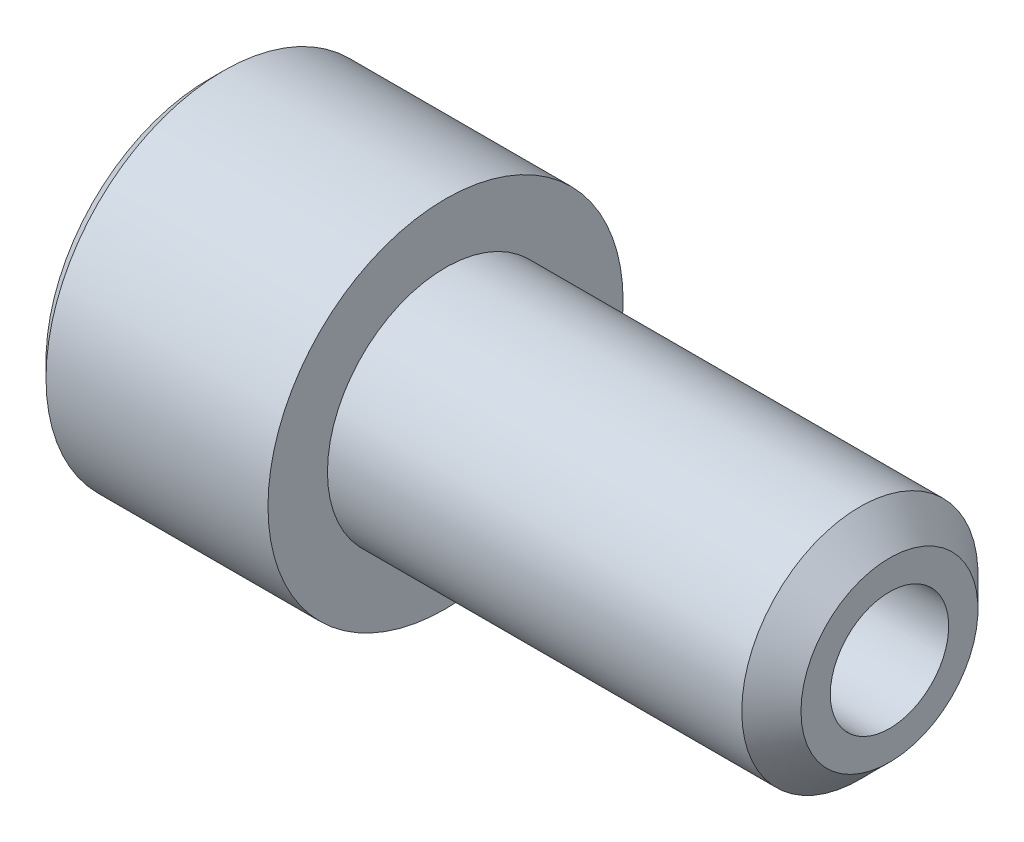
ISO-10303-21;
HEADER;
FILE_DESCRIPTION(('STEP AP214'),'2;1');
FILE_NAME('part.step','',(''),(''),'','','');
FILE_SCHEMA(('AUTOMOTIVE_DESIGN { 1 0 10303 214 1 1 1 1 }'));
ENDSEC;
DATA;
#1=APPLICATION_CONTEXT('core data for automotive mechanical design processes');
#2=APPLICATION_PROTOCOL_DEFINITION('international standard','automotive_design',2000,#1);
#3=PRODUCT_CONTEXT('',#1,'mechanical');
#4=PRODUCT('Part','Part','',(#3));
#5=PRODUCT_RELATED_PRODUCT_CATEGORY('part','',(#4));
#6=PRODUCT_DEFINITION_FORMATION('','',#4);
#7=PRODUCT_DEFINITION_CONTEXT('part definition',#1,'design');
#8=PRODUCT_DEFINITION('design','',#6,#7);
#9=PRODUCT_DEFINITION_SHAPE('','',#8);
#10=(LENGTH_UNIT() NAMED_UNIT(*) SI_UNIT(.MILLI.,.METRE.));
#11=(NAMED_UNIT(*) PLANE_ANGLE_UNIT() SI_UNIT($,.RADIAN.));
#12=(NAMED_UNIT(*) SI_UNIT($,.STERADIAN.) SOLID_ANGLE_UNIT());
#13=UNCERTAINTY_MEASURE_WITH_UNIT(LENGTH_MEASURE(1.E-05),#10,'distance_accuracy_value','');
#14=(GEOMETRIC_REPRESENTATION_CONTEXT(3) GLOBAL_UNCERTAINTY_ASSIGNED_CONTEXT((#13)) GLOBAL_UNIT_ASSIGNED_CONTEXT((#10,
#11,#12)) REPRESENTATION_CONTEXT('',''));
#15=CARTESIAN_POINT('',(0.,0.,0.));
#16=DIRECTION('',(0.,0.,1.));
#17=DIRECTION('',(1.,0.,0.));
#18=AXIS2_PLACEMENT_3D('',#15,#16,#17);
#19=CARTESIAN_POINT('',(0.,0.,0.));
#20=DIRECTION('',(1.,0.,0.));
#21=DIRECTION('',(0.,0.,-1.));
#22=AXIS2_PLACEMENT_3D('',#19,#20,#21);
#23=PLANE('',#22);
#24=DIRECTION('',(0.,0.866025403784439,0.5));
#25=VECTOR('',#24,1.);
#26=CARTESIAN_POINT('',(0.,7.5,-4.90747728811183));
#27=LINE('',#26,#25);
#28=CARTESIAN_POINT('',(0.,0.,-9.23760430703402));
#29=VERTEX_POINT('',#28);
#30=CARTESIAN_POINT('',(0.,8.,-4.61880215351701));
#31=VERTEX_POINT('',#30);
#32=EDGE_CURVE('E171',#29,#31,#27,.T.);
#33=ORIENTED_EDGE('',*,*,#32,.T.);
#34=DIRECTION('',(0.,0.,1.));
#35=VECTOR('',#34,1.);
#36=CARTESIAN_POINT('',(0.,8.,4.04145188432738));
#37=LINE('',#36,#35);
#38=CARTESIAN_POINT('',(0.,8.,4.61880215351701));
#39=VERTEX_POINT('',#38);
#40=EDGE_CURVE('E186',#31,#39,#37,.T.);
#41=ORIENTED_EDGE('',*,*,#40,.T.);
#42=DIRECTION('',(0.,-0.866025403784439,0.5));
#43=VECTOR('',#42,1.);
#44=CARTESIAN_POINT('',(0.,0.500000000000005,8.94892917243921));
#45=LINE('',#44,#43);
#46=CARTESIAN_POINT('',(0.,0.,9.23760430703402));
#47=VERTEX_POINT('',#46);
#48=EDGE_CURVE('E183',#39,#47,#45,.T.);
#49=ORIENTED_EDGE('',*,*,#48,.T.);
#50=DIRECTION('',(0.,-0.866025403784439,-0.5));
#51=VECTOR('',#50,1.);
#52=CARTESIAN_POINT('',(0.,-7.5,4.90747728811183));
#53=LINE('',#52,#51);
#54=CARTESIAN_POINT('',(0.,-8.,4.61880215351701));
#55=VERTEX_POINT('',#54);
#56=EDGE_CURVE('E180',#47,#55,#53,.T.);
#57=ORIENTED_EDGE('',*,*,#56,.T.);
#58=DIRECTION('',(0.,0.,-1.));
#59=VECTOR('',#58,1.);
#60=CARTESIAN_POINT('',(0.,-8.,-4.04145188432738));
#61=LINE('',#60,#59);
#62=CARTESIAN_POINT('',(0.,-8.,-4.61880215351701));
#63=VERTEX_POINT('',#62);
#64=EDGE_CURVE('E177',#55,#63,#61,.T.);
#65=ORIENTED_EDGE('',*,*,#64,.T.);
#66=DIRECTION('',(0.,0.866025403784439,-0.5));
#67=VECTOR('',#66,1.);
#68=CARTESIAN_POINT('',(0.,-0.500000000000001,-8.9489291724392));
#69=LINE('',#68,#67);
#70=EDGE_CURVE('E174',#63,#29,#69,.T.);
#71=ORIENTED_EDGE('',*,*,#70,.T.);
#72=EDGE_LOOP('',(#33,#41,#49,#57,#65,#71));
#73=FACE_BOUND('',#72,.T.);
#74=CARTESIAN_POINT('',(0.,0.,0.));
#75=DIRECTION('',(1.,0.,0.));
#76=DIRECTION('',(0.,0.,-1.));
#77=AXIS2_PLACEMENT_3D('',#74,#75,#76);
#78=CIRCLE('',#77,11.);
#79=CARTESIAN_POINT('',(0.,0.,-11.));
#80=VERTEX_POINT('',#79);
#81=EDGE_CURVE('E163',#80,#80,#78,.F.);
#82=ORIENTED_EDGE('',*,*,#81,.T.);
#83=EDGE_LOOP('',(#82));
#84=FACE_BOUND('',#83,.T.);
#85=ADVANCED_FACE('F39',(#73,#84),#23,.F.);
#86=CARTESIAN_POINT('',(46.,0.,0.));
#87=DIRECTION('',(-1.,0.,0.));
#88=DIRECTION('',(0.,0.,1.));
#89=AXIS2_PLACEMENT_3D('',#86,#87,#88);
#90=PLANE('',#89);
#91=CARTESIAN_POINT('',(46.,0.,0.));
#92=DIRECTION('',(-1.,0.,0.));
#93=DIRECTION('',(0.,0.,1.));
#94=AXIS2_PLACEMENT_3D('',#91,#92,#93);
#95=CIRCLE('',#94,4.);
#96=CARTESIAN_POINT('',(46.,0.,4.));
#97=VERTEX_POINT('',#96);
#98=EDGE_CURVE('E208',#97,#97,#95,.T.);
#99=ORIENTED_EDGE('',*,*,#98,.T.);
#100=EDGE_LOOP('',(#99));
#101=FACE_BOUND('',#100,.T.);
#102=CARTESIAN_POINT('',(46.,0.,0.));
#103=DIRECTION('',(-1.,0.,0.));
#104=DIRECTION('',(0.,0.,1.));
#105=AXIS2_PLACEMENT_3D('',#102,#103,#104);
#106=CIRCLE('',#105,5.98100000000001);
#107=CARTESIAN_POINT('',(46.,0.,5.98100000000001));
#108=VERTEX_POINT('',#107);
#109=EDGE_CURVE('E159',#108,#108,#106,.F.);
#110=ORIENTED_EDGE('',*,*,#109,.T.);
#111=EDGE_LOOP('',(#110));
#112=FACE_BOUND('',#111,.T.);
#113=ADVANCED_FACE('F265',(#101,#112),#90,.F.);
#114=CARTESIAN_POINT('',(-88.7054908485857,0.,0.));
#115=DIRECTION('',(-1.,0.,0.));
#116=DIRECTION('',(0.,0.,1.));
#117=AXIS2_PLACEMENT_3D('',#114,#115,#116);
#118=CYLINDRICAL_SURFACE('',#117,7.981);
#119=CARTESIAN_POINT('',(44.,0.,0.));
#120=DIRECTION('',(-1.,0.,0.));
#121=DIRECTION('',(0.,0.,1.));
#122=AXIS2_PLACEMENT_3D('',#119,#120,#121);
#123=CIRCLE('',#122,7.981);
#124=CARTESIAN_POINT('',(44.,0.,7.981));
#125=VERTEX_POINT('',#124);
#126=EDGE_CURVE('E155',#125,#125,#123,.T.);
#127=ORIENTED_EDGE('',*,*,#126,.T.);
#128=EDGE_LOOP('',(#127));
#129=FACE_BOUND('',#128,.T.);
#130=CARTESIAN_POINT('',(16.,0.,0.));
#131=DIRECTION('',(-1.,0.,0.));
#132=DIRECTION('',(0.,0.,1.));
#133=AXIS2_PLACEMENT_3D('',#130,#131,#132);
#134=CIRCLE('',#133,7.981);
#135=CARTESIAN_POINT('',(16.,0.,7.981));
#136=VERTEX_POINT('',#135);
#137=EDGE_CURVE('E146',#136,#136,#134,.T.);
#138=ORIENTED_EDGE('',*,*,#137,.F.);
#139=EDGE_LOOP('',(#138));
#140=FACE_BOUND('',#139,.T.);
#141=ADVANCED_FACE('F291',(#129,#140),#118,.T.);
#142=CARTESIAN_POINT('',(16.,7.981,0.));
#143=DIRECTION('',(-1.,0.,0.));
#144=DIRECTION('',(0.,0.,1.));
#145=AXIS2_PLACEMENT_3D('',#142,#143,#144);
#146=PLANE('',#145);
#147=CARTESIAN_POINT('',(16.,0.,0.));
#148=DIRECTION('',(-1.,0.,0.));
#149=DIRECTION('',(0.,0.,1.));
#150=AXIS2_PLACEMENT_3D('',#147,#148,#149);
#151=CIRCLE('',#150,12.);
#152=CARTESIAN_POINT('',(16.,0.,12.));
#153=VERTEX_POINT('',#152);
#154=EDGE_CURVE('E140',#153,#153,#151,.T.);
#155=ORIENTED_EDGE('',*,*,#154,.F.);
#156=EDGE_LOOP('',(#155));
#157=FACE_BOUND('',#156,.T.);
#158=ORIENTED_EDGE('',*,*,#137,.T.);
#159=EDGE_LOOP('',(#158));
#160=FACE_BOUND('',#159,.T.);
#161=ADVANCED_FACE('F301',(#157,#160),#146,.F.);
#162=CARTESIAN_POINT('',(-88.7054908485857,0.,0.));
#163=DIRECTION('',(-1.,0.,0.));
#164=DIRECTION('',(0.,0.,1.));
#165=AXIS2_PLACEMENT_3D('',#162,#163,#164);
#166=CYLINDRICAL_SURFACE('',#165,12.);
#167=CARTESIAN_POINT('',(0.999999999999987,0.,0.));
#168=DIRECTION('',(1.,0.,0.));
#169=DIRECTION('',(0.,0.,-1.));
#170=AXIS2_PLACEMENT_3D('',#167,#168,#169);
#171=CIRCLE('',#170,12.);
#172=CARTESIAN_POINT('',(0.999999999999987,0.,-12.));
#173=VERTEX_POINT('',#172);
#174=EDGE_CURVE('E167',#173,#173,#171,.T.);
#175=ORIENTED_EDGE('',*,*,#174,.T.);
#176=EDGE_LOOP('',(#175));
#177=FACE_BOUND('',#176,.T.);
#178=ORIENTED_EDGE('',*,*,#154,.T.);
#179=EDGE_LOOP('',(#178));
#180=FACE_BOUND('',#179,.T.);
#181=ADVANCED_FACE('F297',(#177,#180),#166,.T.);
#182=CARTESIAN_POINT('',(44.,0.,0.));
#183=DIRECTION('',(-1.,0.,0.));
#184=DIRECTION('',(0.,0.,1.));
#185=AXIS2_PLACEMENT_3D('',#182,#183,#184);
#186=CONICAL_SURFACE('',#185,7.981,0.785398163397449);
#187=ORIENTED_EDGE('',*,*,#109,.F.);
#188=EDGE_LOOP('',(#187));
#189=FACE_BOUND('',#188,.T.);
#190=ORIENTED_EDGE('',*,*,#126,.F.);
#191=EDGE_LOOP('',(#190));
#192=FACE_BOUND('',#191,.T.);
#193=ADVANCED_FACE('F300',(#189,#192),#186,.T.);
#194=CARTESIAN_POINT('',(0.,0.,0.));
#195=DIRECTION('',(1.,0.,0.));
#196=DIRECTION('',(0.,0.,-1.));
#197=AXIS2_PLACEMENT_3D('',#194,#195,#196);
#198=CONICAL_SURFACE('',#197,11.,0.785398163397444);
#199=ORIENTED_EDGE('',*,*,#174,.F.);
#200=EDGE_LOOP('',(#199));
#201=FACE_BOUND('',#200,.T.);
#202=ORIENTED_EDGE('',*,*,#81,.F.);
#203=EDGE_LOOP('',(#202));
#204=FACE_BOUND('',#203,.T.);
#205=ADVANCED_FACE('F311',(#201,#204),#198,.T.);
#206=CARTESIAN_POINT('',(8.,7.,4.04145188432738));
#207=DIRECTION('',(0.,-0.5,-0.866025403784439));
#208=DIRECTION('',(0.,0.866025403784438,-0.5));
#209=AXIS2_PLACEMENT_3D('',#206,#207,#208);
#210=PLANE('',#209);
#211=DIRECTION('',(-1.,0.,0.));
#212=VECTOR('',#211,1.);
#213=CARTESIAN_POINT('',(8.,0.,8.08290376865476));
#214=LINE('',#213,#212);
#215=CARTESIAN_POINT('',(8.,0.,8.08290376865476));
#216=VERTEX_POINT('',#215);
#217=CARTESIAN_POINT('',(1.00000000000001,0.,8.08290376865476));
#218=VERTEX_POINT('',#217);
#219=EDGE_CURVE('E130',#216,#218,#214,.T.);
#220=ORIENTED_EDGE('',*,*,#219,.T.);
#221=DIRECTION('',(0.,0.866025403784438,-0.5));
#222=VECTOR('',#221,1.);
#223=CARTESIAN_POINT('',(1.00000000000001,7.,4.04145188432738));
#224=LINE('',#223,#222);
#225=CARTESIAN_POINT('',(1.00000000000001,7.,4.04145188432738));
#226=VERTEX_POINT('',#225);
#227=EDGE_CURVE('E194',#218,#226,#224,.T.);
#228=ORIENTED_EDGE('',*,*,#227,.T.);
#229=DIRECTION('',(-1.,0.,0.));
#230=VECTOR('',#229,1.);
#231=CARTESIAN_POINT('',(8.,7.,4.04145188432738));
#232=LINE('',#231,#230);
#233=CARTESIAN_POINT('',(8.,7.,4.04145188432738));
#234=VERTEX_POINT('',#233);
#235=EDGE_CURVE('E133',#234,#226,#232,.T.);
#236=ORIENTED_EDGE('',*,*,#235,.F.);
#237=DIRECTION('',(0.,-0.866025403784438,0.5));
#238=VECTOR('',#237,1.);
#239=CARTESIAN_POINT('',(8.,7.,4.04145188432738));
#240=LINE('',#239,#238);
#241=EDGE_CURVE('E117',#234,#216,#240,.T.);
#242=ORIENTED_EDGE('',*,*,#241,.T.);
#243=EDGE_LOOP('',(#220,#228,#236,#242));
#244=FACE_BOUND('',#243,.T.);
#245=ADVANCED_FACE('F129',(#244),#210,.T.);
#246=CARTESIAN_POINT('',(8.,0.,8.08290376865476));
#247=DIRECTION('',(0.,0.5,-0.866025403784439));
#248=DIRECTION('',(0.,0.866025403784439,0.5));
#249=AXIS2_PLACEMENT_3D('',#246,#247,#248);
#250=PLANE('',#249);
#251=DIRECTION('',(-1.,0.,0.));
#252=VECTOR('',#251,1.);
#253=CARTESIAN_POINT('',(8.,-7.,4.04145188432738));
#254=LINE('',#253,#252);
#255=CARTESIAN_POINT('',(8.,-7.,4.04145188432738));
#256=VERTEX_POINT('',#255);
#257=CARTESIAN_POINT('',(1.00000000000001,-7.,4.04145188432738));
#258=VERTEX_POINT('',#257);
#259=EDGE_CURVE('E141',#256,#258,#254,.T.);
#260=ORIENTED_EDGE('',*,*,#259,.T.);
#261=DIRECTION('',(0.,0.866025403784439,0.5));
#262=VECTOR('',#261,1.);
#263=CARTESIAN_POINT('',(1.00000000000001,0.,8.08290376865476));
#264=LINE('',#263,#262);
#265=EDGE_CURVE('E138',#258,#218,#264,.T.);
#266=ORIENTED_EDGE('',*,*,#265,.T.);
#267=ORIENTED_EDGE('',*,*,#219,.F.);
#268=DIRECTION('',(0.,-0.866025403784439,-0.5));
#269=VECTOR('',#268,1.);
#270=CARTESIAN_POINT('',(8.,0.,8.08290376865476));
#271=LINE('',#270,#269);
#272=EDGE_CURVE('E113',#216,#256,#271,.T.);
#273=ORIENTED_EDGE('',*,*,#272,.T.);
#274=EDGE_LOOP('',(#260,#266,#267,#273));
#275=FACE_BOUND('',#274,.T.);
#276=ADVANCED_FACE('F136',(#275),#250,.T.);
#277=CARTESIAN_POINT('',(8.,-7.,4.04145188432738));
#278=DIRECTION('',(0.,1.,0.));
#279=DIRECTION('',(0.,0.,1.));
#280=AXIS2_PLACEMENT_3D('',#277,#278,#279);
#281=PLANE('',#280);
#282=DIRECTION('',(-1.,0.,0.));
#283=VECTOR('',#282,1.);
#284=CARTESIAN_POINT('',(8.,-7.,-4.04145188432738));
#285=LINE('',#284,#283);
#286=CARTESIAN_POINT('',(8.,-7.,-4.04145188432738));
#287=VERTEX_POINT('',#286);
#288=CARTESIAN_POINT('',(1.00000000000001,-7.,-4.04145188432738));
#289=VERTEX_POINT('',#288);
#290=EDGE_CURVE('E148',#287,#289,#285,.T.);
#291=ORIENTED_EDGE('',*,*,#290,.T.);
#292=DIRECTION('',(0.,0.,1.));
#293=VECTOR('',#292,1.);
#294=CARTESIAN_POINT('',(1.00000000000001,-7.,4.04145188432738));
#295=LINE('',#294,#293);
#296=EDGE_CURVE('E199',#289,#258,#295,.T.);
#297=ORIENTED_EDGE('',*,*,#296,.T.);
#298=ORIENTED_EDGE('',*,*,#259,.F.);
#299=DIRECTION('',(0.,0.,-1.));
#300=VECTOR('',#299,1.);
#301=CARTESIAN_POINT('',(8.,-7.,4.04145188432738));
#302=LINE('',#301,#300);
#303=EDGE_CURVE('E119',#256,#287,#302,.T.);
#304=ORIENTED_EDGE('',*,*,#303,.T.);
#305=EDGE_LOOP('',(#291,#297,#298,#304));
#306=FACE_BOUND('',#305,.T.);
#307=ADVANCED_FACE('F235',(#306),#281,.T.);
#308=CARTESIAN_POINT('',(8.,-7.,-4.04145188432738));
#309=DIRECTION('',(0.,0.5,0.866025403784439));
#310=DIRECTION('',(0.,-0.866025403784439,0.5));
#311=AXIS2_PLACEMENT_3D('',#308,#309,#310);
#312=PLANE('',#311);
#313=DIRECTION('',(-1.,0.,0.));
#314=VECTOR('',#313,1.);
#315=CARTESIAN_POINT('',(8.,0.,-8.08290376865476));
#316=LINE('',#315,#314);
#317=CARTESIAN_POINT('',(8.,0.,-8.08290376865476));
#318=VERTEX_POINT('',#317);
#319=CARTESIAN_POINT('',(1.00000000000001,0.,-8.08290376865476));
#320=VERTEX_POINT('',#319);
#321=EDGE_CURVE('E237',#318,#320,#316,.T.);
#322=ORIENTED_EDGE('',*,*,#321,.T.);
#323=DIRECTION('',(0.,-0.866025403784439,0.5));
#324=VECTOR('',#323,1.);
#325=CARTESIAN_POINT('',(1.00000000000001,-7.,-4.04145188432738));
#326=LINE('',#325,#324);
#327=EDGE_CURVE('E49',#320,#289,#326,.T.);
#328=ORIENTED_EDGE('',*,*,#327,.T.);
#329=ORIENTED_EDGE('',*,*,#290,.F.);
#330=DIRECTION('',(0.,0.866025403784439,-0.5));
#331=VECTOR('',#330,1.);
#332=CARTESIAN_POINT('',(8.,-7.,-4.04145188432738));
#333=LINE('',#332,#331);
#334=EDGE_CURVE('E252',#287,#318,#333,.T.);
#335=ORIENTED_EDGE('',*,*,#334,.T.);
#336=EDGE_LOOP('',(#322,#328,#329,#335));
#337=FACE_BOUND('',#336,.T.);
#338=ADVANCED_FACE('F404',(#337),#312,.T.);
#339=CARTESIAN_POINT('',(8.,0.,-8.08290376865476));
#340=DIRECTION('',(0.,-0.5,0.866025403784439));
#341=DIRECTION('',(0.,-0.866025403784439,-0.5));
#342=AXIS2_PLACEMENT_3D('',#339,#340,#341);
#343=PLANE('',#342);
#344=DIRECTION('',(-1.,0.,0.));
#345=VECTOR('',#344,1.);
#346=CARTESIAN_POINT('',(8.,7.,-4.04145188432738));
#347=LINE('',#346,#345);
#348=CARTESIAN_POINT('',(8.,7.,-4.04145188432738));
#349=VERTEX_POINT('',#348);
#350=CARTESIAN_POINT('',(1.00000000000001,7.,-4.04145188432738));
#351=VERTEX_POINT('',#350);
#352=EDGE_CURVE('E239',#349,#351,#347,.T.);
#353=ORIENTED_EDGE('',*,*,#352,.T.);
#354=DIRECTION('',(0.,-0.866025403784439,-0.5));
#355=VECTOR('',#354,1.);
#356=CARTESIAN_POINT('',(1.00000000000001,0.,-8.08290376865476));
#357=LINE('',#356,#355);
#358=EDGE_CURVE('E11',#351,#320,#357,.T.);
#359=ORIENTED_EDGE('',*,*,#358,.T.);
#360=ORIENTED_EDGE('',*,*,#321,.F.);
#361=DIRECTION('',(0.,0.866025403784439,0.5));
#362=VECTOR('',#361,1.);
#363=CARTESIAN_POINT('',(8.,0.,-8.08290376865476));
#364=LINE('',#363,#362);
#365=EDGE_CURVE('E249',#318,#349,#364,.T.);
#366=ORIENTED_EDGE('',*,*,#365,.T.);
#367=EDGE_LOOP('',(#353,#359,#360,#366));
#368=FACE_BOUND('',#367,.T.);
#369=ADVANCED_FACE('F282',(#368),#343,.T.);
#370=CARTESIAN_POINT('',(8.,7.,-4.04145188432738));
#371=DIRECTION('',(0.,-1.,0.));
#372=DIRECTION('',(0.,0.,-1.));
#373=AXIS2_PLACEMENT_3D('',#370,#371,#372);
#374=PLANE('',#373);
#375=ORIENTED_EDGE('',*,*,#235,.T.);
#376=DIRECTION('',(0.,0.,-1.));
#377=VECTOR('',#376,1.);
#378=CARTESIAN_POINT('',(1.00000000000001,7.,-4.04145188432738));
#379=LINE('',#378,#377);
#380=EDGE_CURVE('E190',#226,#351,#379,.T.);
#381=ORIENTED_EDGE('',*,*,#380,.T.);
#382=ORIENTED_EDGE('',*,*,#352,.F.);
#383=DIRECTION('',(0.,0.,1.));
#384=VECTOR('',#383,1.);
#385=CARTESIAN_POINT('',(8.,7.,-4.04145188432738));
#386=LINE('',#385,#384);
#387=EDGE_CURVE('E246',#349,#234,#386,.T.);
#388=ORIENTED_EDGE('',*,*,#387,.T.);
#389=EDGE_LOOP('',(#375,#381,#382,#388));
#390=FACE_BOUND('',#389,.T.);
#391=ADVANCED_FACE('F276',(#390),#374,.T.);
#392=CARTESIAN_POINT('',(8.,0.,0.));
#393=DIRECTION('',(1.,0.,0.));
#394=DIRECTION('',(0.,0.,-1.));
#395=AXIS2_PLACEMENT_3D('',#392,#393,#394);
#396=PLANE('',#395);
#397=CARTESIAN_POINT('',(8.,0.,0.));
#398=DIRECTION('',(-1.,0.,0.));
#399=DIRECTION('',(0.,0.,1.));
#400=AXIS2_PLACEMENT_3D('',#397,#398,#399);
#401=CIRCLE('',#400,4.);
#402=CARTESIAN_POINT('',(8.,0.,4.));
#403=VERTEX_POINT('',#402);
#404=EDGE_CURVE('E257',#403,#403,#401,.T.);
#405=ORIENTED_EDGE('',*,*,#404,.F.);
#406=EDGE_LOOP('',(#405));
#407=FACE_BOUND('',#406,.T.);
#408=ORIENTED_EDGE('',*,*,#241,.F.);
#409=ORIENTED_EDGE('',*,*,#387,.F.);
#410=ORIENTED_EDGE('',*,*,#365,.F.);
#411=ORIENTED_EDGE('',*,*,#334,.F.);
#412=ORIENTED_EDGE('',*,*,#303,.F.);
#413=ORIENTED_EDGE('',*,*,#272,.F.);
#414=EDGE_LOOP('',(#408,#409,#410,#411,#412,#413));
#415=FACE_BOUND('',#414,.T.);
#416=ADVANCED_FACE('F115',(#407,#415),#396,.F.);
#417=CARTESIAN_POINT('',(0.,-8.,0.));
#418=DIRECTION('',(-0.707106781186546,0.707106781186549,0.));
#419=DIRECTION('',(0.,0.,1.));
#420=AXIS2_PLACEMENT_3D('',#417,#418,#419);
#421=PLANE('',#420);
#422=DIRECTION('',(0.654653670707978,0.654653670707976,-0.377964473009227));
#423=VECTOR('',#422,1.);
#424=CARTESIAN_POINT('',(1.14285714285714,-6.85714285714286,3.95897327444316));
#425=LINE('',#424,#423);
#426=EDGE_CURVE('E218',#258,#55,#425,.F.);
#427=ORIENTED_EDGE('',*,*,#426,.F.);
#428=ORIENTED_EDGE('',*,*,#296,.F.);
#429=DIRECTION('',(0.654653670707978,0.654653670707975,0.377964473009228));
#430=VECTOR('',#429,1.);
#431=CARTESIAN_POINT('',(1.14285714285715,-6.85714285714286,-3.95897327444315));
#432=LINE('',#431,#430);
#433=EDGE_CURVE('E43',#63,#289,#432,.T.);
#434=ORIENTED_EDGE('',*,*,#433,.F.);
#435=ORIENTED_EDGE('',*,*,#64,.F.);
#436=EDGE_LOOP('',(#427,#428,#434,#435));
#437=FACE_BOUND('',#436,.T.);
#438=ADVANCED_FACE('F41',(#437),#421,.T.);
#439=CARTESIAN_POINT('',(0.,-4.,-6.92820323027551));
#440=DIRECTION('',(-0.707106781186547,0.353553390593274,0.612372435695795));
#441=DIRECTION('',(0.,-0.866025403784439,0.5));
#442=AXIS2_PLACEMENT_3D('',#439,#440,#441);
#443=PLANE('',#442);
#444=ORIENTED_EDGE('',*,*,#433,.T.);
#445=ORIENTED_EDGE('',*,*,#327,.F.);
#446=DIRECTION('',(0.654653670707978,0.,0.755928946018453));
#447=VECTOR('',#446,1.);
#448=CARTESIAN_POINT('',(1.14285714285714,0.,-7.91794654888631));
#449=LINE('',#448,#447);
#450=EDGE_CURVE('E215',#29,#320,#449,.T.);
#451=ORIENTED_EDGE('',*,*,#450,.F.);
#452=ORIENTED_EDGE('',*,*,#70,.F.);
#453=EDGE_LOOP('',(#444,#445,#451,#452));
#454=FACE_BOUND('',#453,.T.);
#455=ADVANCED_FACE('F229',(#454),#443,.T.);
#456=CARTESIAN_POINT('',(0.,-4.,6.92820323027551));
#457=DIRECTION('',(-0.707106781186546,0.353553390593274,-0.612372435695796));
#458=DIRECTION('',(0.,0.866025403784439,0.5));
#459=AXIS2_PLACEMENT_3D('',#456,#457,#458);
#460=PLANE('',#459);
#461=ORIENTED_EDGE('',*,*,#426,.T.);
#462=ORIENTED_EDGE('',*,*,#56,.F.);
#463=DIRECTION('',(0.654653670707978,0.,-0.755928946018454));
#464=VECTOR('',#463,1.);
#465=CARTESIAN_POINT('',(1.14285714285714,0.,7.91794654888631));
#466=LINE('',#465,#464);
#467=EDGE_CURVE('E211',#218,#47,#466,.F.);
#468=ORIENTED_EDGE('',*,*,#467,.F.);
#469=ORIENTED_EDGE('',*,*,#265,.F.);
#470=EDGE_LOOP('',(#461,#462,#468,#469));
#471=FACE_BOUND('',#470,.T.);
#472=ADVANCED_FACE('F326',(#471),#460,.T.);
#473=CARTESIAN_POINT('',(0.,4.,-6.92820323027551));
#474=DIRECTION('',(-0.707106781186546,-0.353553390593274,0.612372435695796));
#475=DIRECTION('',(0.,-0.866025403784439,-0.5));
#476=AXIS2_PLACEMENT_3D('',#473,#474,#475);
#477=PLANE('',#476);
#478=ORIENTED_EDGE('',*,*,#450,.T.);
#479=ORIENTED_EDGE('',*,*,#358,.F.);
#480=DIRECTION('',(-0.654653670707978,0.654653670707976,-0.377964473009226));
#481=VECTOR('',#480,1.);
#482=CARTESIAN_POINT('',(1.14285714285714,6.85714285714286,-3.95897327444316));
#483=LINE('',#482,#481);
#484=EDGE_CURVE('E207',#31,#351,#483,.F.);
#485=ORIENTED_EDGE('',*,*,#484,.F.);
#486=ORIENTED_EDGE('',*,*,#32,.F.);
#487=EDGE_LOOP('',(#478,#479,#485,#486));
#488=FACE_BOUND('',#487,.T.);
#489=ADVANCED_FACE('F322',(#488),#477,.T.);
#490=CARTESIAN_POINT('',(0.,4.,6.92820323027551));
#491=DIRECTION('',(-0.707106781186547,-0.353553390593274,-0.612372435695795));
#492=DIRECTION('',(0.,0.866025403784438,-0.5));
#493=AXIS2_PLACEMENT_3D('',#490,#491,#492);
#494=PLANE('',#493);
#495=ORIENTED_EDGE('',*,*,#467,.T.);
#496=ORIENTED_EDGE('',*,*,#48,.F.);
#497=DIRECTION('',(0.654653670707978,-0.654653670707976,-0.377964473009228));
#498=VECTOR('',#497,1.);
#499=CARTESIAN_POINT('',(1.14285714285715,6.85714285714286,3.95897327444315));
#500=LINE('',#499,#498);
#501=EDGE_CURVE('E204',#226,#39,#500,.F.);
#502=ORIENTED_EDGE('',*,*,#501,.F.);
#503=ORIENTED_EDGE('',*,*,#227,.F.);
#504=EDGE_LOOP('',(#495,#496,#502,#503));
#505=FACE_BOUND('',#504,.T.);
#506=ADVANCED_FACE('F318',(#505),#494,.T.);
#507=CARTESIAN_POINT('',(0.,8.,0.));
#508=DIRECTION('',(-0.707106781186546,-0.707106781186549,0.));
#509=DIRECTION('',(0.,0.,-1.));
#510=AXIS2_PLACEMENT_3D('',#507,#508,#509);
#511=PLANE('',#510);
#512=ORIENTED_EDGE('',*,*,#484,.T.);
#513=ORIENTED_EDGE('',*,*,#380,.F.);
#514=ORIENTED_EDGE('',*,*,#501,.T.);
#515=ORIENTED_EDGE('',*,*,#40,.F.);
#516=EDGE_LOOP('',(#512,#513,#514,#515));
#517=FACE_BOUND('',#516,.T.);
#518=ADVANCED_FACE('F271',(#517),#511,.T.);
#519=CARTESIAN_POINT('',(46.,0.,0.));
#520=DIRECTION('',(-1.,0.,0.));
#521=DIRECTION('',(0.,0.,1.));
#522=AXIS2_PLACEMENT_3D('',#519,#520,#521);
#523=CYLINDRICAL_SURFACE('',#522,4.);
#524=ORIENTED_EDGE('',*,*,#98,.F.);
#525=EDGE_LOOP('',(#524));
#526=FACE_BOUND('',#525,.T.);
#527=ORIENTED_EDGE('',*,*,#404,.T.);
#528=EDGE_LOOP('',(#527));
#529=FACE_BOUND('',#528,.T.);
#530=ADVANCED_FACE('F268',(#526,#529),#523,.F.);
#531=CLOSED_SHELL('',(#85,#113,#141,#161,#181,#193,#205,#245,#276,#307,#338,#369,#391,#416,#438,
#455,#472,#489,#506,#518,#530));
#532=MANIFOLD_SOLID_BREP('B2',#531);
#533=ADVANCED_BREP_SHAPE_REPRESENTATION('',(#18,#532),#14);
#534=SHAPE_DEFINITION_REPRESENTATION(#9,#533);
ENDSEC;
END-ISO-10303-21;
